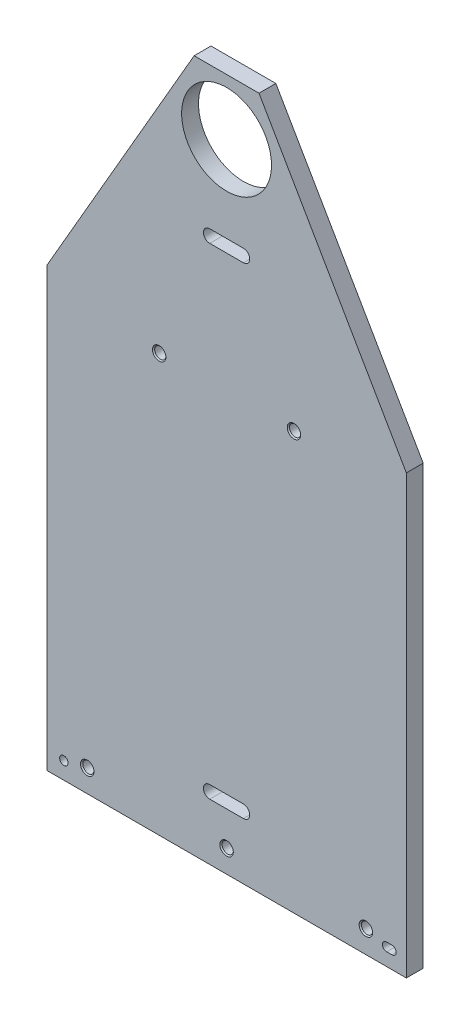
ISO-10303-21;
HEADER;
FILE_DESCRIPTION(('STEP AP214'),'2;1');
FILE_NAME('part.step','',(''),(''),'','','');
FILE_SCHEMA(('AUTOMOTIVE_DESIGN { 1 0 10303 214 1 1 1 1 }'));
ENDSEC;
DATA;
#1=APPLICATION_CONTEXT('core data for automotive mechanical design processes');
#2=APPLICATION_PROTOCOL_DEFINITION('international standard','automotive_design',2000,#1);
#3=PRODUCT_CONTEXT('',#1,'mechanical');
#4=PRODUCT('Part','Part','',(#3));
#5=PRODUCT_RELATED_PRODUCT_CATEGORY('part','',(#4));
#6=PRODUCT_DEFINITION_FORMATION('','',#4);
#7=PRODUCT_DEFINITION_CONTEXT('part definition',#1,'design');
#8=PRODUCT_DEFINITION('design','',#6,#7);
#9=PRODUCT_DEFINITION_SHAPE('','',#8);
#10=(LENGTH_UNIT() NAMED_UNIT(*) SI_UNIT(.MILLI.,.METRE.));
#11=(NAMED_UNIT(*) PLANE_ANGLE_UNIT() SI_UNIT($,.RADIAN.));
#12=(NAMED_UNIT(*) SI_UNIT($,.STERADIAN.) SOLID_ANGLE_UNIT());
#13=UNCERTAINTY_MEASURE_WITH_UNIT(LENGTH_MEASURE(1.E-05),#10,'distance_accuracy_value','');
#14=(GEOMETRIC_REPRESENTATION_CONTEXT(3) GLOBAL_UNCERTAINTY_ASSIGNED_CONTEXT((#13)) GLOBAL_UNIT_ASSIGNED_CONTEXT((#10,
#11,#12)) REPRESENTATION_CONTEXT('',''));
#15=CARTESIAN_POINT('',(0.,0.,0.));
#16=DIRECTION('',(0.,0.,1.));
#17=DIRECTION('',(1.,0.,0.));
#18=AXIS2_PLACEMENT_3D('',#15,#16,#17);
#19=CARTESIAN_POINT('',(0.,0.,4.7625));
#20=DIRECTION('',(0.,0.,-1.));
#21=DIRECTION('',(-1.,0.,0.));
#22=AXIS2_PLACEMENT_3D('',#19,#20,#21);
#23=PLANE('',#22);
#24=CARTESIAN_POINT('',(0.,12.6999999999998,4.7625));
#25=DIRECTION('',(0.,0.,1.));
#26=DIRECTION('',(1.,0.,0.));
#27=AXIS2_PLACEMENT_3D('',#24,#25,#26);
#28=CIRCLE('',#27,3.81);
#29=CARTESIAN_POINT('',(3.80999999999999,12.6999999999998,4.7625));
#30=VERTEX_POINT('',#29);
#31=EDGE_CURVE('E508',#30,#30,#28,.T.);
#32=ORIENTED_EDGE('',*,*,#31,.F.);
#33=EDGE_LOOP('',(#32));
#34=FACE_BOUND('',#33,.T.);
#35=CARTESIAN_POINT('',(78.74,12.6999999999998,4.7625));
#36=DIRECTION('',(0.,0.,1.));
#37=DIRECTION('',(1.,0.,0.));
#38=AXIS2_PLACEMENT_3D('',#35,#36,#37);
#39=CIRCLE('',#38,3.80999999999999);
#40=CARTESIAN_POINT('',(82.55,12.6999999999998,4.7625));
#41=VERTEX_POINT('',#40);
#42=EDGE_CURVE('E521',#41,#41,#39,.T.);
#43=ORIENTED_EDGE('',*,*,#42,.F.);
#44=EDGE_LOOP('',(#43));
#45=FACE_BOUND('',#44,.T.);
#46=CARTESIAN_POINT('',(38.1,235.8771,4.7625));
#47=DIRECTION('',(0.,0.,1.));
#48=DIRECTION('',(1.,0.,0.));
#49=AXIS2_PLACEMENT_3D('',#46,#47,#48);
#50=CIRCLE('',#49,3.81);
#51=CARTESIAN_POINT('',(41.91,235.8771,4.7625));
#52=VERTEX_POINT('',#51);
#53=EDGE_CURVE('E225',#52,#52,#50,.T.);
#54=ORIENTED_EDGE('',*,*,#53,.F.);
#55=EDGE_LOOP('',(#54));
#56=FACE_BOUND('',#55,.T.);
#57=DIRECTION('',(-1.,0.,0.));
#58=VECTOR('',#57,1.);
#59=CARTESIAN_POINT('',(9.52499999999995,311.162700000002,4.7625));
#60=LINE('',#59,#58);
#61=CARTESIAN_POINT('',(9.52499999999995,311.162700000002,4.7625));
#62=VERTEX_POINT('',#61);
#63=CARTESIAN_POINT('',(-9.52500000000005,311.162700000002,4.7625));
#64=VERTEX_POINT('',#63);
#65=EDGE_CURVE('E250',#62,#64,#60,.T.);
#66=ORIENTED_EDGE('',*,*,#65,.F.);
#67=CARTESIAN_POINT('',(9.52499999999994,307.594000000002,4.7625));
#68=DIRECTION('',(0.,0.,1.));
#69=DIRECTION('',(1.,0.,0.));
#70=AXIS2_PLACEMENT_3D('',#67,#68,#69);
#71=CIRCLE('',#70,3.56869999999998);
#72=CARTESIAN_POINT('',(9.52499999999995,304.025300000002,4.7625));
#73=VERTEX_POINT('',#72);
#74=EDGE_CURVE('E234',#73,#62,#71,.T.);
#75=ORIENTED_EDGE('',*,*,#74,.F.);
#76=DIRECTION('',(1.,0.,0.));
#77=VECTOR('',#76,1.);
#78=CARTESIAN_POINT('',(9.52499999999995,304.025300000002,4.7625));
#79=LINE('',#78,#77);
#80=CARTESIAN_POINT('',(-9.52500000000005,304.025300000002,4.7625));
#81=VERTEX_POINT('',#80);
#82=EDGE_CURVE('E239',#81,#73,#79,.T.);
#83=ORIENTED_EDGE('',*,*,#82,.F.);
#84=CARTESIAN_POINT('',(-9.52500000000006,307.594000000002,4.7625));
#85=DIRECTION('',(0.,0.,1.));
#86=DIRECTION('',(1.,0.,0.));
#87=AXIS2_PLACEMENT_3D('',#84,#85,#86);
#88=CIRCLE('',#87,3.56870000000001);
#89=EDGE_CURVE('E253',#64,#81,#88,.T.);
#90=ORIENTED_EDGE('',*,*,#89,.F.);
#91=EDGE_LOOP('',(#66,#75,#83,#90));
#92=FACE_BOUND('',#91,.T.);
#93=DIRECTION('',(-1.,0.,0.));
#94=VECTOR('',#93,1.);
#95=CARTESIAN_POINT('',(9.52500000000009,39.1287000000017,4.7625));
#96=LINE('',#95,#94);
#97=CARTESIAN_POINT('',(9.52500000000009,39.1287000000017,4.7625));
#98=VERTEX_POINT('',#97);
#99=CARTESIAN_POINT('',(-9.52499999999991,39.1287000000017,4.7625));
#100=VERTEX_POINT('',#99);
#101=EDGE_CURVE('E282',#98,#100,#96,.T.);
#102=ORIENTED_EDGE('',*,*,#101,.F.);
#103=CARTESIAN_POINT('',(9.5250000000001,35.5600000000017,4.7625));
#104=DIRECTION('',(0.,0.,1.));
#105=DIRECTION('',(-1.,0.,0.));
#106=AXIS2_PLACEMENT_3D('',#103,#104,#105);
#107=CIRCLE('',#106,3.5687);
#108=CARTESIAN_POINT('',(9.52500000000009,31.9913000000017,4.7625));
#109=VERTEX_POINT('',#108);
#110=EDGE_CURVE('E260',#109,#98,#107,.T.);
#111=ORIENTED_EDGE('',*,*,#110,.F.);
#112=DIRECTION('',(1.,0.,0.));
#113=VECTOR('',#112,1.);
#114=CARTESIAN_POINT('',(9.52500000000009,31.9913000000017,4.7625));
#115=LINE('',#114,#113);
#116=CARTESIAN_POINT('',(-9.52499999999991,31.9913000000017,4.7625));
#117=VERTEX_POINT('',#116);
#118=EDGE_CURVE('E271',#117,#109,#115,.T.);
#119=ORIENTED_EDGE('',*,*,#118,.F.);
#120=CARTESIAN_POINT('',(-9.5249999999999,35.5600000000017,4.7625));
#121=DIRECTION('',(0.,0.,1.));
#122=DIRECTION('',(-1.,0.,0.));
#123=AXIS2_PLACEMENT_3D('',#120,#121,#122);
#124=CIRCLE('',#123,3.5687);
#125=EDGE_CURVE('E285',#100,#117,#124,.T.);
#126=ORIENTED_EDGE('',*,*,#125,.F.);
#127=EDGE_LOOP('',(#102,#111,#119,#126));
#128=FACE_BOUND('',#127,.T.);
#129=CARTESIAN_POINT('',(0.,359.7021,4.7625));
#130=DIRECTION('',(0.,0.,1.));
#131=DIRECTION('',(1.,0.,0.));
#132=AXIS2_PLACEMENT_3D('',#129,#130,#131);
#133=CIRCLE('',#132,25.4);
#134=CARTESIAN_POINT('',(25.4,359.7021,4.7625));
#135=VERTEX_POINT('',#134);
#136=EDGE_CURVE('E292',#135,#135,#133,.T.);
#137=ORIENTED_EDGE('',*,*,#136,.F.);
#138=EDGE_LOOP('',(#137));
#139=FACE_BOUND('',#138,.T.);
#140=DIRECTION('',(0.,-1.,0.));
#141=VECTOR('',#140,1.);
#142=CARTESIAN_POINT('',(-101.6,0.,4.7625));
#143=LINE('',#142,#141);
#144=CARTESIAN_POINT('',(-101.6,247.225737951,4.7625));
#145=VERTEX_POINT('',#144);
#146=CARTESIAN_POINT('',(-101.6,0.,4.7625));
#147=VERTEX_POINT('',#146);
#148=EDGE_CURVE('E302',#145,#147,#143,.T.);
#149=ORIENTED_EDGE('',*,*,#148,.T.);
#150=DIRECTION('',(1.,0.,0.));
#151=VECTOR('',#150,1.);
#152=CARTESIAN_POINT('',(-101.6,0.,4.7625));
#153=LINE('',#152,#151);
#154=CARTESIAN_POINT('',(101.6,0.,4.7625));
#155=VERTEX_POINT('',#154);
#156=EDGE_CURVE('E326',#147,#155,#153,.T.);
#157=ORIENTED_EDGE('',*,*,#156,.T.);
#158=DIRECTION('',(0.,1.,0.));
#159=VECTOR('',#158,1.);
#160=CARTESIAN_POINT('',(101.6,247.225737951,4.7625));
#161=LINE('',#160,#159);
#162=CARTESIAN_POINT('',(101.6,247.225737951,4.7625));
#163=VERTEX_POINT('',#162);
#164=EDGE_CURVE('E329',#155,#163,#161,.T.);
#165=ORIENTED_EDGE('',*,*,#164,.T.);
#166=DIRECTION('',(-0.499999999999994,0.866025403784442,0.));
#167=VECTOR('',#166,1.);
#168=CARTESIAN_POINT('',(18.3308710467708,391.4521,4.7625));
#169=LINE('',#168,#167);
#170=CARTESIAN_POINT('',(18.3308710467708,391.4521,4.7625));
#171=VERTEX_POINT('',#170);
#172=EDGE_CURVE('E332',#163,#171,#169,.T.);
#173=ORIENTED_EDGE('',*,*,#172,.T.);
#174=DIRECTION('',(-1.,0.,0.));
#175=VECTOR('',#174,1.);
#176=CARTESIAN_POINT('',(-18.3308710467708,391.4521,4.7625));
#177=LINE('',#176,#175);
#178=CARTESIAN_POINT('',(-18.3308710467708,391.4521,4.7625));
#179=VERTEX_POINT('',#178);
#180=EDGE_CURVE('E335',#171,#179,#177,.T.);
#181=ORIENTED_EDGE('',*,*,#180,.T.);
#182=DIRECTION('',(-0.499999999999994,-0.866025403784442,0.));
#183=VECTOR('',#182,1.);
#184=CARTESIAN_POINT('',(-18.3308710467708,391.4521,4.7625));
#185=LINE('',#184,#183);
#186=EDGE_CURVE('E309',#179,#145,#185,.T.);
#187=ORIENTED_EDGE('',*,*,#186,.T.);
#188=EDGE_LOOP('',(#149,#157,#165,#173,#181,#187));
#189=FACE_BOUND('',#188,.T.);
#190=CARTESIAN_POINT('',(-38.1,235.8771,4.7625));
#191=DIRECTION('',(0.,0.,1.));
#192=DIRECTION('',(1.,0.,0.));
#193=AXIS2_PLACEMENT_3D('',#190,#191,#192);
#194=CIRCLE('',#193,3.81);
#195=CARTESIAN_POINT('',(-34.29,235.8771,4.7625));
#196=VERTEX_POINT('',#195);
#197=EDGE_CURVE('E213',#196,#196,#194,.T.);
#198=ORIENTED_EDGE('',*,*,#197,.F.);
#199=EDGE_LOOP('',(#198));
#200=FACE_BOUND('',#199,.T.);
#201=CARTESIAN_POINT('',(-91.9480000000001,9.65199999999999,4.7625));
#202=DIRECTION('',(0.,0.,1.));
#203=DIRECTION('',(1.,0.,0.));
#204=AXIS2_PLACEMENT_3D('',#201,#202,#203);
#205=CIRCLE('',#204,2.3876);
#206=CARTESIAN_POINT('',(-89.5604000000001,9.65199999999999,4.7625));
#207=VERTEX_POINT('',#206);
#208=EDGE_CURVE('E201',#207,#207,#205,.T.);
#209=ORIENTED_EDGE('',*,*,#208,.F.);
#210=EDGE_LOOP('',(#209));
#211=FACE_BOUND('',#210,.T.);
#212=DIRECTION('',(1.,0.,0.));
#213=VECTOR('',#212,1.);
#214=CARTESIAN_POINT('',(90.424,7.2644,4.7625));
#215=LINE('',#214,#213);
#216=CARTESIAN_POINT('',(90.424,7.2644,4.7625));
#217=VERTEX_POINT('',#216);
#218=CARTESIAN_POINT('',(93.4720000000001,7.2644,4.7625));
#219=VERTEX_POINT('',#218);
#220=EDGE_CURVE('E195',#217,#219,#215,.T.);
#221=ORIENTED_EDGE('',*,*,#220,.F.);
#222=CARTESIAN_POINT('',(90.424,9.65199999999999,4.7625));
#223=DIRECTION('',(0.,0.,1.));
#224=DIRECTION('',(1.,0.,0.));
#225=AXIS2_PLACEMENT_3D('',#222,#223,#224);
#226=CIRCLE('',#225,2.38759999999999);
#227=CARTESIAN_POINT('',(90.424,12.0396,4.7625));
#228=VERTEX_POINT('',#227);
#229=EDGE_CURVE('E56',#228,#217,#226,.T.);
#230=ORIENTED_EDGE('',*,*,#229,.F.);
#231=DIRECTION('',(-1.,0.,0.));
#232=VECTOR('',#231,1.);
#233=CARTESIAN_POINT('',(90.424,12.0396,4.7625));
#234=LINE('',#233,#232);
#235=CARTESIAN_POINT('',(93.4720000000001,12.0396,4.7625));
#236=VERTEX_POINT('',#235);
#237=EDGE_CURVE('E183',#236,#228,#234,.T.);
#238=ORIENTED_EDGE('',*,*,#237,.F.);
#239=CARTESIAN_POINT('',(93.4720000000001,9.65199999999999,4.7625));
#240=DIRECTION('',(0.,0.,1.));
#241=DIRECTION('',(1.,0.,0.));
#242=AXIS2_PLACEMENT_3D('',#239,#240,#241);
#243=CIRCLE('',#242,2.38759999999999);
#244=EDGE_CURVE('E186',#219,#236,#243,.T.);
#245=ORIENTED_EDGE('',*,*,#244,.F.);
#246=EDGE_LOOP('',(#221,#230,#238,#245));
#247=FACE_BOUND('',#246,.T.);
#248=CARTESIAN_POINT('',(-78.74,12.6999999999998,4.7625));
#249=DIRECTION('',(0.,0.,1.));
#250=DIRECTION('',(1.,0.,0.));
#251=AXIS2_PLACEMENT_3D('',#248,#249,#250);
#252=CIRCLE('',#251,3.80999999999999);
#253=CARTESIAN_POINT('',(-74.93,12.6999999999998,4.7625));
#254=VERTEX_POINT('',#253);
#255=EDGE_CURVE('E533',#254,#254,#252,.T.);
#256=ORIENTED_EDGE('',*,*,#255,.F.);
#257=EDGE_LOOP('',(#256));
#258=FACE_BOUND('',#257,.T.);
#259=ADVANCED_FACE('F39',(#34,#45,#56,#92,#128,#139,#189,#200,#211,#247,#258),#23,.F.);
#260=CARTESIAN_POINT('',(-101.6,0.,-4.7625));
#261=DIRECTION('',(-1.,0.,0.));
#262=DIRECTION('',(0.,-1.,0.));
#263=AXIS2_PLACEMENT_3D('',#260,#261,#262);
#264=PLANE('',#263);
#265=ORIENTED_EDGE('',*,*,#148,.F.);
#266=DIRECTION('',(0.,0.,1.));
#267=VECTOR('',#266,1.);
#268=CARTESIAN_POINT('',(-101.6,247.225737951,-4.7625));
#269=LINE('',#268,#267);
#270=CARTESIAN_POINT('',(-101.6,247.225737951,-4.7625));
#271=VERTEX_POINT('',#270);
#272=EDGE_CURVE('E11',#271,#145,#269,.T.);
#273=ORIENTED_EDGE('',*,*,#272,.F.);
#274=DIRECTION('',(0.,-1.,0.));
#275=VECTOR('',#274,1.);
#276=CARTESIAN_POINT('',(-101.6,0.,-4.7625));
#277=LINE('',#276,#275);
#278=CARTESIAN_POINT('',(-101.6,0.,-4.7625));
#279=VERTEX_POINT('',#278);
#280=EDGE_CURVE('E305',#271,#279,#277,.T.);
#281=ORIENTED_EDGE('',*,*,#280,.T.);
#282=DIRECTION('',(0.,0.,1.));
#283=VECTOR('',#282,1.);
#284=CARTESIAN_POINT('',(-101.6,0.,-4.7625));
#285=LINE('',#284,#283);
#286=EDGE_CURVE('E43',#279,#147,#285,.T.);
#287=ORIENTED_EDGE('',*,*,#286,.T.);
#288=EDGE_LOOP('',(#265,#273,#281,#287));
#289=FACE_BOUND('',#288,.T.);
#290=ADVANCED_FACE('F41',(#289),#264,.T.);
#291=CARTESIAN_POINT('',(-18.3308710467708,391.4521,-4.7625));
#292=DIRECTION('',(-0.866025403784442,0.499999999999994,0.));
#293=DIRECTION('',(-0.499999999999994,-0.866025403784442,0.));
#294=AXIS2_PLACEMENT_3D('',#291,#292,#293);
#295=PLANE('',#294);
#296=ORIENTED_EDGE('',*,*,#186,.F.);
#297=DIRECTION('',(0.,0.,1.));
#298=VECTOR('',#297,1.);
#299=CARTESIAN_POINT('',(-18.3308710467708,391.4521,-4.7625));
#300=LINE('',#299,#298);
#301=CARTESIAN_POINT('',(-18.3308710467708,391.4521,-4.7625));
#302=VERTEX_POINT('',#301);
#303=EDGE_CURVE('E48',#302,#179,#300,.T.);
#304=ORIENTED_EDGE('',*,*,#303,.F.);
#305=DIRECTION('',(-0.499999999999994,-0.866025403784442,0.));
#306=VECTOR('',#305,1.);
#307=CARTESIAN_POINT('',(-18.3308710467708,391.4521,-4.7625));
#308=LINE('',#307,#306);
#309=EDGE_CURVE('E321',#302,#271,#308,.T.);
#310=ORIENTED_EDGE('',*,*,#309,.T.);
#311=ORIENTED_EDGE('',*,*,#272,.T.);
#312=EDGE_LOOP('',(#296,#304,#310,#311));
#313=FACE_BOUND('',#312,.T.);
#314=ADVANCED_FACE('F358',(#313),#295,.T.);
#315=CARTESIAN_POINT('',(-18.3308710467708,391.4521,-4.7625));
#316=DIRECTION('',(0.,1.,0.));
#317=DIRECTION('',(0.,0.,1.));
#318=AXIS2_PLACEMENT_3D('',#315,#316,#317);
#319=PLANE('',#318);
#320=ORIENTED_EDGE('',*,*,#180,.F.);
#321=DIRECTION('',(0.,0.,1.));
#322=VECTOR('',#321,1.);
#323=CARTESIAN_POINT('',(18.3308710467708,391.4521,-4.7625));
#324=LINE('',#323,#322);
#325=CARTESIAN_POINT('',(18.3308710467708,391.4521,-4.7625));
#326=VERTEX_POINT('',#325);
#327=EDGE_CURVE('E341',#326,#171,#324,.T.);
#328=ORIENTED_EDGE('',*,*,#327,.F.);
#329=DIRECTION('',(-1.,0.,0.));
#330=VECTOR('',#329,1.);
#331=CARTESIAN_POINT('',(-18.3308710467708,391.4521,-4.7625));
#332=LINE('',#331,#330);
#333=EDGE_CURVE('E318',#326,#302,#332,.T.);
#334=ORIENTED_EDGE('',*,*,#333,.T.);
#335=ORIENTED_EDGE('',*,*,#303,.T.);
#336=EDGE_LOOP('',(#320,#328,#334,#335));
#337=FACE_BOUND('',#336,.T.);
#338=ADVANCED_FACE('F370',(#337),#319,.T.);
#339=CARTESIAN_POINT('',(18.3308710467708,391.4521,-4.7625));
#340=DIRECTION('',(0.866025403784442,0.499999999999994,0.));
#341=DIRECTION('',(-0.499999999999994,0.866025403784442,0.));
#342=AXIS2_PLACEMENT_3D('',#339,#340,#341);
#343=PLANE('',#342);
#344=ORIENTED_EDGE('',*,*,#172,.F.);
#345=DIRECTION('',(0.,0.,1.));
#346=VECTOR('',#345,1.);
#347=CARTESIAN_POINT('',(101.6,247.225737951,-4.7625));
#348=LINE('',#347,#346);
#349=CARTESIAN_POINT('',(101.6,247.225737951,-4.7625));
#350=VERTEX_POINT('',#349);
#351=EDGE_CURVE('E343',#350,#163,#348,.T.);
#352=ORIENTED_EDGE('',*,*,#351,.F.);
#353=DIRECTION('',(-0.499999999999994,0.866025403784442,0.));
#354=VECTOR('',#353,1.);
#355=CARTESIAN_POINT('',(18.3308710467708,391.4521,-4.7625));
#356=LINE('',#355,#354);
#357=EDGE_CURVE('E315',#350,#326,#356,.T.);
#358=ORIENTED_EDGE('',*,*,#357,.T.);
#359=ORIENTED_EDGE('',*,*,#327,.T.);
#360=EDGE_LOOP('',(#344,#352,#358,#359));
#361=FACE_BOUND('',#360,.T.);
#362=ADVANCED_FACE('F368',(#361),#343,.T.);
#363=CARTESIAN_POINT('',(101.6,247.225737951,-4.7625));
#364=DIRECTION('',(1.,0.,0.));
#365=DIRECTION('',(0.,1.,0.));
#366=AXIS2_PLACEMENT_3D('',#363,#364,#365);
#367=PLANE('',#366);
#368=ORIENTED_EDGE('',*,*,#164,.F.);
#369=DIRECTION('',(0.,0.,1.));
#370=VECTOR('',#369,1.);
#371=CARTESIAN_POINT('',(101.6,0.,-4.7625));
#372=LINE('',#371,#370);
#373=CARTESIAN_POINT('',(101.6,0.,-4.7625));
#374=VERTEX_POINT('',#373);
#375=EDGE_CURVE('E344',#374,#155,#372,.T.);
#376=ORIENTED_EDGE('',*,*,#375,.F.);
#377=DIRECTION('',(0.,1.,0.));
#378=VECTOR('',#377,1.);
#379=CARTESIAN_POINT('',(101.6,247.225737951,-4.7625));
#380=LINE('',#379,#378);
#381=EDGE_CURVE('E312',#374,#350,#380,.T.);
#382=ORIENTED_EDGE('',*,*,#381,.T.);
#383=ORIENTED_EDGE('',*,*,#351,.T.);
#384=EDGE_LOOP('',(#368,#376,#382,#383));
#385=FACE_BOUND('',#384,.T.);
#386=ADVANCED_FACE('F365',(#385),#367,.T.);
#387=CARTESIAN_POINT('',(-101.6,0.,-4.7625));
#388=DIRECTION('',(0.,-1.,0.));
#389=DIRECTION('',(1.,0.,0.));
#390=AXIS2_PLACEMENT_3D('',#387,#388,#389);
#391=PLANE('',#390);
#392=ORIENTED_EDGE('',*,*,#156,.F.);
#393=ORIENTED_EDGE('',*,*,#286,.F.);
#394=DIRECTION('',(1.,0.,0.));
#395=VECTOR('',#394,1.);
#396=CARTESIAN_POINT('',(-101.6,0.,-4.7625));
#397=LINE('',#396,#395);
#398=EDGE_CURVE('E308',#279,#374,#397,.T.);
#399=ORIENTED_EDGE('',*,*,#398,.T.);
#400=ORIENTED_EDGE('',*,*,#375,.T.);
#401=EDGE_LOOP('',(#392,#393,#399,#400));
#402=FACE_BOUND('',#401,.T.);
#403=ADVANCED_FACE('F352',(#402),#391,.T.);
#404=CARTESIAN_POINT('',(0.,0.,-4.7625));
#405=DIRECTION('',(0.,0.,-1.));
#406=DIRECTION('',(-1.,0.,0.));
#407=AXIS2_PLACEMENT_3D('',#404,#405,#406);
#408=PLANE('',#407);
#409=CARTESIAN_POINT('',(0.,12.6999999999998,-4.7625));
#410=DIRECTION('',(0.,0.,1.));
#411=DIRECTION('',(1.,0.,0.));
#412=AXIS2_PLACEMENT_3D('',#409,#410,#411);
#413=CIRCLE('',#412,3.81);
#414=CARTESIAN_POINT('',(3.80999999999999,12.6999999999998,-4.7625));
#415=VERTEX_POINT('',#414);
#416=EDGE_CURVE('E509',#415,#415,#413,.T.);
#417=ORIENTED_EDGE('',*,*,#416,.T.);
#418=EDGE_LOOP('',(#417));
#419=FACE_BOUND('',#418,.T.);
#420=CARTESIAN_POINT('',(78.74,12.6999999999998,-4.7625));
#421=DIRECTION('',(0.,0.,1.));
#422=DIRECTION('',(1.,0.,0.));
#423=AXIS2_PLACEMENT_3D('',#420,#421,#422);
#424=CIRCLE('',#423,3.80999999999999);
#425=CARTESIAN_POINT('',(82.55,12.6999999999998,-4.7625));
#426=VERTEX_POINT('',#425);
#427=EDGE_CURVE('E518',#426,#426,#424,.T.);
#428=ORIENTED_EDGE('',*,*,#427,.T.);
#429=EDGE_LOOP('',(#428));
#430=FACE_BOUND('',#429,.T.);
#431=CARTESIAN_POINT('',(-78.74,12.6999999999998,-4.7625));
#432=DIRECTION('',(0.,0.,1.));
#433=DIRECTION('',(1.,0.,0.));
#434=AXIS2_PLACEMENT_3D('',#431,#432,#433);
#435=CIRCLE('',#434,3.80999999999999);
#436=CARTESIAN_POINT('',(-74.93,12.6999999999998,-4.7625));
#437=VERTEX_POINT('',#436);
#438=EDGE_CURVE('E530',#437,#437,#435,.T.);
#439=ORIENTED_EDGE('',*,*,#438,.T.);
#440=EDGE_LOOP('',(#439));
#441=FACE_BOUND('',#440,.T.);
#442=CARTESIAN_POINT('',(90.424,9.65199999999999,-4.7625));
#443=DIRECTION('',(0.,0.,1.));
#444=DIRECTION('',(1.,0.,0.));
#445=AXIS2_PLACEMENT_3D('',#442,#443,#444);
#446=CIRCLE('',#445,2.38759999999999);
#447=CARTESIAN_POINT('',(90.424,12.0396,-4.7625));
#448=VERTEX_POINT('',#447);
#449=CARTESIAN_POINT('',(90.424,7.2644,-4.7625));
#450=VERTEX_POINT('',#449);
#451=EDGE_CURVE('E167',#448,#450,#446,.T.);
#452=ORIENTED_EDGE('',*,*,#451,.T.);
#453=DIRECTION('',(1.,0.,0.));
#454=VECTOR('',#453,1.);
#455=CARTESIAN_POINT('',(90.424,7.2644,-4.7625));
#456=LINE('',#455,#454);
#457=CARTESIAN_POINT('',(93.4720000000001,7.2644,-4.7625));
#458=VERTEX_POINT('',#457);
#459=EDGE_CURVE('E176',#450,#458,#456,.T.);
#460=ORIENTED_EDGE('',*,*,#459,.T.);
#461=CARTESIAN_POINT('',(93.4720000000001,9.65199999999999,-4.7625));
#462=DIRECTION('',(0.,0.,1.));
#463=DIRECTION('',(1.,0.,0.));
#464=AXIS2_PLACEMENT_3D('',#461,#462,#463);
#465=CIRCLE('',#464,2.38759999999999);
#466=CARTESIAN_POINT('',(93.4720000000001,12.0396,-4.7625));
#467=VERTEX_POINT('',#466);
#468=EDGE_CURVE('E64',#458,#467,#465,.T.);
#469=ORIENTED_EDGE('',*,*,#468,.T.);
#470=DIRECTION('',(-1.,0.,0.));
#471=VECTOR('',#470,1.);
#472=CARTESIAN_POINT('',(90.424,12.0396,-4.7625));
#473=LINE('',#472,#471);
#474=EDGE_CURVE('E173',#467,#448,#473,.T.);
#475=ORIENTED_EDGE('',*,*,#474,.T.);
#476=EDGE_LOOP('',(#452,#460,#469,#475));
#477=FACE_BOUND('',#476,.T.);
#478=CARTESIAN_POINT('',(-91.9480000000001,9.65199999999999,-4.7625));
#479=DIRECTION('',(0.,0.,1.));
#480=DIRECTION('',(1.,0.,0.));
#481=AXIS2_PLACEMENT_3D('',#478,#479,#480);
#482=CIRCLE('',#481,2.3876);
#483=CARTESIAN_POINT('',(-89.5604000000001,9.65199999999999,-4.7625));
#484=VERTEX_POINT('',#483);
#485=EDGE_CURVE('E207',#484,#484,#482,.T.);
#486=ORIENTED_EDGE('',*,*,#485,.T.);
#487=EDGE_LOOP('',(#486));
#488=FACE_BOUND('',#487,.T.);
#489=CARTESIAN_POINT('',(-38.1,235.8771,-4.7625));
#490=DIRECTION('',(0.,0.,1.));
#491=DIRECTION('',(1.,0.,0.));
#492=AXIS2_PLACEMENT_3D('',#489,#490,#491);
#493=CIRCLE('',#492,3.81);
#494=CARTESIAN_POINT('',(-34.29,235.8771,-4.7625));
#495=VERTEX_POINT('',#494);
#496=EDGE_CURVE('E210',#495,#495,#493,.T.);
#497=ORIENTED_EDGE('',*,*,#496,.T.);
#498=EDGE_LOOP('',(#497));
#499=FACE_BOUND('',#498,.T.);
#500=CARTESIAN_POINT('',(38.1,235.8771,-4.7625));
#501=DIRECTION('',(0.,0.,1.));
#502=DIRECTION('',(1.,0.,0.));
#503=AXIS2_PLACEMENT_3D('',#500,#501,#502);
#504=CIRCLE('',#503,3.80999999999999);
#505=CARTESIAN_POINT('',(41.91,235.8771,-4.7625));
#506=VERTEX_POINT('',#505);
#507=EDGE_CURVE('E222',#506,#506,#504,.T.);
#508=ORIENTED_EDGE('',*,*,#507,.T.);
#509=EDGE_LOOP('',(#508));
#510=FACE_BOUND('',#509,.T.);
#511=CARTESIAN_POINT('',(9.52499999999994,307.594000000002,-4.7625));
#512=DIRECTION('',(0.,0.,1.));
#513=DIRECTION('',(1.,0.,0.));
#514=AXIS2_PLACEMENT_3D('',#511,#512,#513);
#515=CIRCLE('',#514,3.56869999999998);
#516=CARTESIAN_POINT('',(9.52499999999995,304.025300000002,-4.7625));
#517=VERTEX_POINT('',#516);
#518=CARTESIAN_POINT('',(9.52499999999995,311.162700000002,-4.7625));
#519=VERTEX_POINT('',#518);
#520=EDGE_CURVE('E235',#517,#519,#515,.T.);
#521=ORIENTED_EDGE('',*,*,#520,.T.);
#522=DIRECTION('',(-1.,0.,0.));
#523=VECTOR('',#522,1.);
#524=CARTESIAN_POINT('',(9.52499999999995,311.162700000002,-4.7625));
#525=LINE('',#524,#523);
#526=CARTESIAN_POINT('',(-9.52500000000005,311.162700000002,-4.7625));
#527=VERTEX_POINT('',#526);
#528=EDGE_CURVE('E238',#519,#527,#525,.T.);
#529=ORIENTED_EDGE('',*,*,#528,.T.);
#530=CARTESIAN_POINT('',(-9.52500000000006,307.594000000002,-4.7625));
#531=DIRECTION('',(0.,0.,1.));
#532=DIRECTION('',(1.,0.,0.));
#533=AXIS2_PLACEMENT_3D('',#530,#531,#532);
#534=CIRCLE('',#533,3.56870000000001);
#535=CARTESIAN_POINT('',(-9.52500000000005,304.025300000002,-4.7625));
#536=VERTEX_POINT('',#535);
#537=EDGE_CURVE('E242',#527,#536,#534,.T.);
#538=ORIENTED_EDGE('',*,*,#537,.T.);
#539=DIRECTION('',(1.,0.,0.));
#540=VECTOR('',#539,1.);
#541=CARTESIAN_POINT('',(9.52499999999995,304.025300000002,-4.7625));
#542=LINE('',#541,#540);
#543=EDGE_CURVE('E245',#536,#517,#542,.T.);
#544=ORIENTED_EDGE('',*,*,#543,.T.);
#545=EDGE_LOOP('',(#521,#529,#538,#544));
#546=FACE_BOUND('',#545,.T.);
#547=CARTESIAN_POINT('',(9.5250000000001,35.5600000000017,-4.7625));
#548=DIRECTION('',(0.,0.,1.));
#549=DIRECTION('',(-1.,0.,0.));
#550=AXIS2_PLACEMENT_3D('',#547,#548,#549);
#551=CIRCLE('',#550,3.5687);
#552=CARTESIAN_POINT('',(9.52500000000009,31.9913000000017,-4.7625));
#553=VERTEX_POINT('',#552);
#554=CARTESIAN_POINT('',(9.52500000000009,39.1287000000017,-4.7625));
#555=VERTEX_POINT('',#554);
#556=EDGE_CURVE('E267',#553,#555,#551,.T.);
#557=ORIENTED_EDGE('',*,*,#556,.T.);
#558=DIRECTION('',(-1.,0.,0.));
#559=VECTOR('',#558,1.);
#560=CARTESIAN_POINT('',(9.52500000000009,39.1287000000017,-4.7625));
#561=LINE('',#560,#559);
#562=CARTESIAN_POINT('',(-9.52499999999991,39.1287000000017,-4.7625));
#563=VERTEX_POINT('',#562);
#564=EDGE_CURVE('E270',#555,#563,#561,.T.);
#565=ORIENTED_EDGE('',*,*,#564,.T.);
#566=CARTESIAN_POINT('',(-9.5249999999999,35.5600000000017,-4.7625));
#567=DIRECTION('',(0.,0.,1.));
#568=DIRECTION('',(-1.,0.,0.));
#569=AXIS2_PLACEMENT_3D('',#566,#567,#568);
#570=CIRCLE('',#569,3.5687);
#571=CARTESIAN_POINT('',(-9.52499999999991,31.9913000000017,-4.7625));
#572=VERTEX_POINT('',#571);
#573=EDGE_CURVE('E274',#563,#572,#570,.T.);
#574=ORIENTED_EDGE('',*,*,#573,.T.);
#575=DIRECTION('',(1.,0.,0.));
#576=VECTOR('',#575,1.);
#577=CARTESIAN_POINT('',(9.52500000000009,31.9913000000017,-4.7625));
#578=LINE('',#577,#576);
#579=EDGE_CURVE('E277',#572,#553,#578,.T.);
#580=ORIENTED_EDGE('',*,*,#579,.T.);
#581=EDGE_LOOP('',(#557,#565,#574,#580));
#582=FACE_BOUND('',#581,.T.);
#583=CARTESIAN_POINT('',(0.,359.7021,-4.7625));
#584=DIRECTION('',(0.,0.,1.));
#585=DIRECTION('',(1.,0.,0.));
#586=AXIS2_PLACEMENT_3D('',#583,#584,#585);
#587=CIRCLE('',#586,25.4);
#588=CARTESIAN_POINT('',(25.4,359.7021,-4.7625));
#589=VERTEX_POINT('',#588);
#590=EDGE_CURVE('E299',#589,#589,#587,.T.);
#591=ORIENTED_EDGE('',*,*,#590,.T.);
#592=EDGE_LOOP('',(#591));
#593=FACE_BOUND('',#592,.T.);
#594=ORIENTED_EDGE('',*,*,#280,.F.);
#595=ORIENTED_EDGE('',*,*,#309,.F.);
#596=ORIENTED_EDGE('',*,*,#333,.F.);
#597=ORIENTED_EDGE('',*,*,#357,.F.);
#598=ORIENTED_EDGE('',*,*,#381,.F.);
#599=ORIENTED_EDGE('',*,*,#398,.F.);
#600=EDGE_LOOP('',(#594,#595,#596,#597,#598,#599));
#601=FACE_BOUND('',#600,.T.);
#602=ADVANCED_FACE('F180',(#419,#430,#441,#477,#488,#499,#510,#546,#582,#593,#601),#408,.T.);
#603=CARTESIAN_POINT('',(0.,359.7021,-4.7625));
#604=DIRECTION('',(0.,0.,1.));
#605=DIRECTION('',(1.,0.,0.));
#606=AXIS2_PLACEMENT_3D('',#603,#604,#605);
#607=CYLINDRICAL_SURFACE('',#606,25.4);
#608=ORIENTED_EDGE('',*,*,#590,.F.);
#609=EDGE_LOOP('',(#608));
#610=FACE_BOUND('',#609,.T.);
#611=ORIENTED_EDGE('',*,*,#136,.T.);
#612=EDGE_LOOP('',(#611));
#613=FACE_BOUND('',#612,.T.);
#614=ADVANCED_FACE('F390',(#610,#613),#607,.F.);
#615=CARTESIAN_POINT('',(9.5250000000001,35.5600000000017,-4.7625));
#616=DIRECTION('',(0.,0.,1.));
#617=DIRECTION('',(1.,0.,0.));
#618=AXIS2_PLACEMENT_3D('',#615,#616,#617);
#619=CYLINDRICAL_SURFACE('',#618,3.5687);
#620=ORIENTED_EDGE('',*,*,#110,.T.);
#621=DIRECTION('',(0.,0.,1.));
#622=VECTOR('',#621,1.);
#623=CARTESIAN_POINT('',(9.52500000000009,39.1287000000017,-4.7625));
#624=LINE('',#623,#622);
#625=EDGE_CURVE('E280',#555,#98,#624,.T.);
#626=ORIENTED_EDGE('',*,*,#625,.F.);
#627=ORIENTED_EDGE('',*,*,#556,.F.);
#628=DIRECTION('',(0.,0.,1.));
#629=VECTOR('',#628,1.);
#630=CARTESIAN_POINT('',(9.52500000000009,31.9913000000017,-4.7625));
#631=LINE('',#630,#629);
#632=EDGE_CURVE('E290',#553,#109,#631,.T.);
#633=ORIENTED_EDGE('',*,*,#632,.T.);
#634=EDGE_LOOP('',(#620,#626,#627,#633));
#635=FACE_BOUND('',#634,.T.);
#636=ADVANCED_FACE('F394',(#635),#619,.F.);
#637=CARTESIAN_POINT('',(9.52500000000009,31.9913000000017,-4.7625));
#638=DIRECTION('',(0.,-1.,0.));
#639=DIRECTION('',(1.,0.,0.));
#640=AXIS2_PLACEMENT_3D('',#637,#638,#639);
#641=PLANE('',#640);
#642=ORIENTED_EDGE('',*,*,#118,.T.);
#643=ORIENTED_EDGE('',*,*,#632,.F.);
#644=ORIENTED_EDGE('',*,*,#579,.F.);
#645=DIRECTION('',(0.,0.,1.));
#646=VECTOR('',#645,1.);
#647=CARTESIAN_POINT('',(-9.52499999999991,31.9913000000017,-4.7625));
#648=LINE('',#647,#646);
#649=EDGE_CURVE('E293',#572,#117,#648,.T.);
#650=ORIENTED_EDGE('',*,*,#649,.T.);
#651=EDGE_LOOP('',(#642,#643,#644,#650));
#652=FACE_BOUND('',#651,.T.);
#653=ADVANCED_FACE('F398',(#652),#641,.F.);
#654=CARTESIAN_POINT('',(-9.5249999999999,35.5600000000017,-4.7625));
#655=DIRECTION('',(0.,0.,1.));
#656=DIRECTION('',(1.,0.,0.));
#657=AXIS2_PLACEMENT_3D('',#654,#655,#656);
#658=CYLINDRICAL_SURFACE('',#657,3.5687);
#659=ORIENTED_EDGE('',*,*,#125,.T.);
#660=ORIENTED_EDGE('',*,*,#649,.F.);
#661=ORIENTED_EDGE('',*,*,#573,.F.);
#662=DIRECTION('',(0.,0.,1.));
#663=VECTOR('',#662,1.);
#664=CARTESIAN_POINT('',(-9.52499999999991,39.1287000000017,-4.7625));
#665=LINE('',#664,#663);
#666=EDGE_CURVE('E295',#563,#100,#665,.T.);
#667=ORIENTED_EDGE('',*,*,#666,.T.);
#668=EDGE_LOOP('',(#659,#660,#661,#667));
#669=FACE_BOUND('',#668,.T.);
#670=ADVANCED_FACE('F404',(#669),#658,.F.);
#671=CARTESIAN_POINT('',(9.52500000000009,39.1287000000017,-4.7625));
#672=DIRECTION('',(0.,1.,0.));
#673=DIRECTION('',(0.,0.,1.));
#674=AXIS2_PLACEMENT_3D('',#671,#672,#673);
#675=PLANE('',#674);
#676=ORIENTED_EDGE('',*,*,#101,.T.);
#677=ORIENTED_EDGE('',*,*,#666,.F.);
#678=ORIENTED_EDGE('',*,*,#564,.F.);
#679=ORIENTED_EDGE('',*,*,#625,.T.);
#680=EDGE_LOOP('',(#676,#677,#678,#679));
#681=FACE_BOUND('',#680,.T.);
#682=ADVANCED_FACE('F400',(#681),#675,.F.);
#683=CARTESIAN_POINT('',(9.52499999999994,307.594000000002,-4.7625));
#684=DIRECTION('',(0.,0.,1.));
#685=DIRECTION('',(1.,0.,0.));
#686=AXIS2_PLACEMENT_3D('',#683,#684,#685);
#687=CYLINDRICAL_SURFACE('',#686,3.56869999999998);
#688=ORIENTED_EDGE('',*,*,#74,.T.);
#689=DIRECTION('',(0.,0.,1.));
#690=VECTOR('',#689,1.);
#691=CARTESIAN_POINT('',(9.52499999999995,311.162700000002,-4.7625));
#692=LINE('',#691,#690);
#693=EDGE_CURVE('E248',#519,#62,#692,.T.);
#694=ORIENTED_EDGE('',*,*,#693,.F.);
#695=ORIENTED_EDGE('',*,*,#520,.F.);
#696=DIRECTION('',(0.,0.,1.));
#697=VECTOR('',#696,1.);
#698=CARTESIAN_POINT('',(9.52499999999995,304.025300000002,-4.7625));
#699=LINE('',#698,#697);
#700=EDGE_CURVE('E258',#517,#73,#699,.T.);
#701=ORIENTED_EDGE('',*,*,#700,.T.);
#702=EDGE_LOOP('',(#688,#694,#695,#701));
#703=FACE_BOUND('',#702,.T.);
#704=ADVANCED_FACE('F403',(#703),#687,.F.);
#705=CARTESIAN_POINT('',(9.52499999999995,304.025300000002,-4.7625));
#706=DIRECTION('',(0.,-1.,0.));
#707=DIRECTION('',(1.,0.,0.));
#708=AXIS2_PLACEMENT_3D('',#705,#706,#707);
#709=PLANE('',#708);
#710=ORIENTED_EDGE('',*,*,#82,.T.);
#711=ORIENTED_EDGE('',*,*,#700,.F.);
#712=ORIENTED_EDGE('',*,*,#543,.F.);
#713=DIRECTION('',(0.,0.,1.));
#714=VECTOR('',#713,1.);
#715=CARTESIAN_POINT('',(-9.52500000000005,304.025300000002,-4.7625));
#716=LINE('',#715,#714);
#717=EDGE_CURVE('E261',#536,#81,#716,.T.);
#718=ORIENTED_EDGE('',*,*,#717,.T.);
#719=EDGE_LOOP('',(#710,#711,#712,#718));
#720=FACE_BOUND('',#719,.T.);
#721=ADVANCED_FACE('F414',(#720),#709,.F.);
#722=CARTESIAN_POINT('',(-9.52500000000006,307.594000000002,-4.7625));
#723=DIRECTION('',(0.,0.,1.));
#724=DIRECTION('',(1.,0.,0.));
#725=AXIS2_PLACEMENT_3D('',#722,#723,#724);
#726=CYLINDRICAL_SURFACE('',#725,3.56870000000001);
#727=ORIENTED_EDGE('',*,*,#89,.T.);
#728=ORIENTED_EDGE('',*,*,#717,.F.);
#729=ORIENTED_EDGE('',*,*,#537,.F.);
#730=DIRECTION('',(0.,0.,1.));
#731=VECTOR('',#730,1.);
#732=CARTESIAN_POINT('',(-9.52500000000005,311.162700000002,-4.7625));
#733=LINE('',#732,#731);
#734=EDGE_CURVE('E263',#527,#64,#733,.T.);
#735=ORIENTED_EDGE('',*,*,#734,.T.);
#736=EDGE_LOOP('',(#727,#728,#729,#735));
#737=FACE_BOUND('',#736,.T.);
#738=ADVANCED_FACE('F420',(#737),#726,.F.);
#739=CARTESIAN_POINT('',(9.52499999999995,311.162700000002,-4.7625));
#740=DIRECTION('',(0.,1.,0.));
#741=DIRECTION('',(0.,0.,1.));
#742=AXIS2_PLACEMENT_3D('',#739,#740,#741);
#743=PLANE('',#742);
#744=ORIENTED_EDGE('',*,*,#65,.T.);
#745=ORIENTED_EDGE('',*,*,#734,.F.);
#746=ORIENTED_EDGE('',*,*,#528,.F.);
#747=ORIENTED_EDGE('',*,*,#693,.T.);
#748=EDGE_LOOP('',(#744,#745,#746,#747));
#749=FACE_BOUND('',#748,.T.);
#750=ADVANCED_FACE('F416',(#749),#743,.F.);
#751=CARTESIAN_POINT('',(38.1,235.8771,-4.1275));
#752=DIRECTION('',(0.,0.,-1.));
#753=DIRECTION('',(-1.,0.,0.));
#754=AXIS2_PLACEMENT_3D('',#751,#752,#753);
#755=CONICAL_SURFACE('',#754,3.175,0.785398163397443);
#756=ORIENTED_EDGE('',*,*,#507,.F.);
#757=EDGE_LOOP('',(#756));
#758=FACE_BOUND('',#757,.T.);
#759=CARTESIAN_POINT('',(38.1,235.8771,-4.1275));
#760=DIRECTION('',(0.,0.,1.));
#761=DIRECTION('',(1.,0.,0.));
#762=AXIS2_PLACEMENT_3D('',#759,#760,#761);
#763=CIRCLE('',#762,3.175);
#764=CARTESIAN_POINT('',(41.275,235.8771,-4.1275));
#765=VERTEX_POINT('',#764);
#766=EDGE_CURVE('E231',#765,#765,#763,.T.);
#767=ORIENTED_EDGE('',*,*,#766,.T.);
#768=EDGE_LOOP('',(#767));
#769=FACE_BOUND('',#768,.T.);
#770=ADVANCED_FACE('F419',(#758,#769),#755,.F.);
#771=CARTESIAN_POINT('',(38.1,235.8771,4.7625));
#772=DIRECTION('',(0.,0.,1.));
#773=DIRECTION('',(1.,0.,0.));
#774=AXIS2_PLACEMENT_3D('',#771,#772,#773);
#775=CYLINDRICAL_SURFACE('',#774,3.17499999999999);
#776=ORIENTED_EDGE('',*,*,#766,.F.);
#777=EDGE_LOOP('',(#776));
#778=FACE_BOUND('',#777,.T.);
#779=CARTESIAN_POINT('',(38.1,235.8771,4.12749999999999));
#780=DIRECTION('',(0.,0.,1.));
#781=DIRECTION('',(1.,0.,0.));
#782=AXIS2_PLACEMENT_3D('',#779,#780,#781);
#783=CIRCLE('',#782,3.17499999999998);
#784=CARTESIAN_POINT('',(41.275,235.8771,4.12749999999999));
#785=VERTEX_POINT('',#784);
#786=EDGE_CURVE('E228',#785,#785,#783,.T.);
#787=ORIENTED_EDGE('',*,*,#786,.T.);
#788=EDGE_LOOP('',(#787));
#789=FACE_BOUND('',#788,.T.);
#790=ADVANCED_FACE('F430',(#778,#789),#775,.F.);
#791=CARTESIAN_POINT('',(38.1,235.8771,4.7625));
#792=DIRECTION('',(0.,0.,1.));
#793=DIRECTION('',(1.,0.,0.));
#794=AXIS2_PLACEMENT_3D('',#791,#792,#793);
#795=CONICAL_SURFACE('',#794,3.81,0.785398163397452);
#796=ORIENTED_EDGE('',*,*,#786,.F.);
#797=EDGE_LOOP('',(#796));
#798=FACE_BOUND('',#797,.T.);
#799=ORIENTED_EDGE('',*,*,#53,.T.);
#800=EDGE_LOOP('',(#799));
#801=FACE_BOUND('',#800,.T.);
#802=ADVANCED_FACE('F434',(#798,#801),#795,.F.);
#803=CARTESIAN_POINT('',(-38.1,235.8771,-4.1275));
#804=DIRECTION('',(0.,0.,-1.));
#805=DIRECTION('',(-1.,0.,0.));
#806=AXIS2_PLACEMENT_3D('',#803,#804,#805);
#807=CONICAL_SURFACE('',#806,3.175,0.785398163397448);
#808=ORIENTED_EDGE('',*,*,#496,.F.);
#809=EDGE_LOOP('',(#808));
#810=FACE_BOUND('',#809,.T.);
#811=CARTESIAN_POINT('',(-38.1,235.8771,-4.1275));
#812=DIRECTION('',(0.,0.,1.));
#813=DIRECTION('',(1.,0.,0.));
#814=AXIS2_PLACEMENT_3D('',#811,#812,#813);
#815=CIRCLE('',#814,3.175);
#816=CARTESIAN_POINT('',(-34.925,235.8771,-4.1275));
#817=VERTEX_POINT('',#816);
#818=EDGE_CURVE('E219',#817,#817,#815,.T.);
#819=ORIENTED_EDGE('',*,*,#818,.T.);
#820=EDGE_LOOP('',(#819));
#821=FACE_BOUND('',#820,.T.);
#822=ADVANCED_FACE('F438',(#810,#821),#807,.F.);
#823=CARTESIAN_POINT('',(-38.1,235.8771,4.7625));
#824=DIRECTION('',(0.,0.,1.));
#825=DIRECTION('',(1.,0.,0.));
#826=AXIS2_PLACEMENT_3D('',#823,#824,#825);
#827=CYLINDRICAL_SURFACE('',#826,3.17499999999999);
#828=ORIENTED_EDGE('',*,*,#818,.F.);
#829=EDGE_LOOP('',(#828));
#830=FACE_BOUND('',#829,.T.);
#831=CARTESIAN_POINT('',(-38.1,235.8771,4.12749999999999));
#832=DIRECTION('',(0.,0.,1.));
#833=DIRECTION('',(1.,0.,0.));
#834=AXIS2_PLACEMENT_3D('',#831,#832,#833);
#835=CIRCLE('',#834,3.17499999999999);
#836=CARTESIAN_POINT('',(-34.925,235.8771,4.12749999999999));
#837=VERTEX_POINT('',#836);
#838=EDGE_CURVE('E216',#837,#837,#835,.T.);
#839=ORIENTED_EDGE('',*,*,#838,.T.);
#840=EDGE_LOOP('',(#839));
#841=FACE_BOUND('',#840,.T.);
#842=ADVANCED_FACE('F442',(#830,#841),#827,.F.);
#843=CARTESIAN_POINT('',(-38.1,235.8771,4.7625));
#844=DIRECTION('',(0.,0.,1.));
#845=DIRECTION('',(1.,0.,0.));
#846=AXIS2_PLACEMENT_3D('',#843,#844,#845);
#847=CONICAL_SURFACE('',#846,3.81,0.785398163397447);
#848=ORIENTED_EDGE('',*,*,#838,.F.);
#849=EDGE_LOOP('',(#848));
#850=FACE_BOUND('',#849,.T.);
#851=ORIENTED_EDGE('',*,*,#197,.T.);
#852=EDGE_LOOP('',(#851));
#853=FACE_BOUND('',#852,.T.);
#854=ADVANCED_FACE('F446',(#850,#853),#847,.F.);
#855=CARTESIAN_POINT('',(-91.9480000000001,9.65199999999999,4.7625));
#856=DIRECTION('',(0.,0.,1.));
#857=DIRECTION('',(1.,0.,0.));
#858=AXIS2_PLACEMENT_3D('',#855,#856,#857);
#859=CYLINDRICAL_SURFACE('',#858,2.3876);
#860=ORIENTED_EDGE('',*,*,#485,.F.);
#861=EDGE_LOOP('',(#860));
#862=FACE_BOUND('',#861,.T.);
#863=ORIENTED_EDGE('',*,*,#208,.T.);
#864=EDGE_LOOP('',(#863));
#865=FACE_BOUND('',#864,.T.);
#866=ADVANCED_FACE('F450',(#862,#865),#859,.F.);
#867=CARTESIAN_POINT('',(90.424,9.65199999999999,-4.7625));
#868=DIRECTION('',(0.,0.,1.));
#869=DIRECTION('',(1.,0.,0.));
#870=AXIS2_PLACEMENT_3D('',#867,#868,#869);
#871=CYLINDRICAL_SURFACE('',#870,2.38759999999999);
#872=ORIENTED_EDGE('',*,*,#229,.T.);
#873=DIRECTION('',(0.,0.,1.));
#874=VECTOR('',#873,1.);
#875=CARTESIAN_POINT('',(90.424,7.2644,-4.7625));
#876=LINE('',#875,#874);
#877=EDGE_CURVE('E163',#450,#217,#876,.T.);
#878=ORIENTED_EDGE('',*,*,#877,.F.);
#879=ORIENTED_EDGE('',*,*,#451,.F.);
#880=DIRECTION('',(0.,0.,1.));
#881=VECTOR('',#880,1.);
#882=CARTESIAN_POINT('',(90.424,12.0396,-4.7625));
#883=LINE('',#882,#881);
#884=EDGE_CURVE('E199',#448,#228,#883,.T.);
#885=ORIENTED_EDGE('',*,*,#884,.T.);
#886=EDGE_LOOP('',(#872,#878,#879,#885));
#887=FACE_BOUND('',#886,.T.);
#888=ADVANCED_FACE('F165',(#887),#871,.F.);
#889=CARTESIAN_POINT('',(90.424,12.0396,-4.7625));
#890=DIRECTION('',(0.,1.,0.));
#891=DIRECTION('',(0.,0.,1.));
#892=AXIS2_PLACEMENT_3D('',#889,#890,#891);
#893=PLANE('',#892);
#894=ORIENTED_EDGE('',*,*,#237,.T.);
#895=ORIENTED_EDGE('',*,*,#884,.F.);
#896=ORIENTED_EDGE('',*,*,#474,.F.);
#897=DIRECTION('',(0.,0.,1.));
#898=VECTOR('',#897,1.);
#899=CARTESIAN_POINT('',(93.4720000000001,12.0396,-4.7625));
#900=LINE('',#899,#898);
#901=EDGE_CURVE('E202',#467,#236,#900,.T.);
#902=ORIENTED_EDGE('',*,*,#901,.T.);
#903=EDGE_LOOP('',(#894,#895,#896,#902));
#904=FACE_BOUND('',#903,.T.);
#905=ADVANCED_FACE('F457',(#904),#893,.F.);
#906=CARTESIAN_POINT('',(93.4720000000001,9.65199999999999,-4.7625));
#907=DIRECTION('',(0.,0.,1.));
#908=DIRECTION('',(1.,0.,0.));
#909=AXIS2_PLACEMENT_3D('',#906,#907,#908);
#910=CYLINDRICAL_SURFACE('',#909,2.38759999999999);
#911=ORIENTED_EDGE('',*,*,#244,.T.);
#912=ORIENTED_EDGE('',*,*,#901,.F.);
#913=ORIENTED_EDGE('',*,*,#468,.F.);
#914=DIRECTION('',(0.,0.,1.));
#915=VECTOR('',#914,1.);
#916=CARTESIAN_POINT('',(93.4720000000001,7.2644,-4.7625));
#917=LINE('',#916,#915);
#918=EDGE_CURVE('E172',#458,#219,#917,.T.);
#919=ORIENTED_EDGE('',*,*,#918,.T.);
#920=EDGE_LOOP('',(#911,#912,#913,#919));
#921=FACE_BOUND('',#920,.T.);
#922=ADVANCED_FACE('F461',(#921),#910,.F.);
#923=CARTESIAN_POINT('',(90.424,7.2644,-4.7625));
#924=DIRECTION('',(0.,-1.,0.));
#925=DIRECTION('',(1.,0.,0.));
#926=AXIS2_PLACEMENT_3D('',#923,#924,#925);
#927=PLANE('',#926);
#928=ORIENTED_EDGE('',*,*,#220,.T.);
#929=ORIENTED_EDGE('',*,*,#918,.F.);
#930=ORIENTED_EDGE('',*,*,#459,.F.);
#931=ORIENTED_EDGE('',*,*,#877,.T.);
#932=EDGE_LOOP('',(#928,#929,#930,#931));
#933=FACE_BOUND('',#932,.T.);
#934=ADVANCED_FACE('F177',(#933),#927,.F.);
#935=CARTESIAN_POINT('',(-78.74,12.6999999999998,-4.1275));
#936=DIRECTION('',(0.,0.,-1.));
#937=DIRECTION('',(-1.,0.,0.));
#938=AXIS2_PLACEMENT_3D('',#935,#936,#937);
#939=CONICAL_SURFACE('',#938,3.175,0.785398163397446);
#940=ORIENTED_EDGE('',*,*,#438,.F.);
#941=EDGE_LOOP('',(#940));
#942=FACE_BOUND('',#941,.T.);
#943=CARTESIAN_POINT('',(-78.74,12.6999999999998,-4.1275));
#944=DIRECTION('',(0.,0.,1.));
#945=DIRECTION('',(1.,0.,0.));
#946=AXIS2_PLACEMENT_3D('',#943,#944,#945);
#947=CIRCLE('',#946,3.175);
#948=CARTESIAN_POINT('',(-75.565,12.6999999999998,-4.1275));
#949=VERTEX_POINT('',#948);
#950=EDGE_CURVE('E189',#949,#949,#947,.T.);
#951=ORIENTED_EDGE('',*,*,#950,.T.);
#952=EDGE_LOOP('',(#951));
#953=FACE_BOUND('',#952,.T.);
#954=ADVANCED_FACE('F460',(#942,#953),#939,.F.);
#955=CARTESIAN_POINT('',(-78.74,12.6999999999998,4.7625));
#956=DIRECTION('',(0.,0.,1.));
#957=DIRECTION('',(1.,0.,0.));
#958=AXIS2_PLACEMENT_3D('',#955,#956,#957);
#959=CYLINDRICAL_SURFACE('',#958,3.175);
#960=ORIENTED_EDGE('',*,*,#950,.F.);
#961=EDGE_LOOP('',(#960));
#962=FACE_BOUND('',#961,.T.);
#963=CARTESIAN_POINT('',(-78.74,12.6999999999998,4.1275));
#964=DIRECTION('',(0.,0.,1.));
#965=DIRECTION('',(1.,0.,0.));
#966=AXIS2_PLACEMENT_3D('',#963,#964,#965);
#967=CIRCLE('',#966,3.175);
#968=CARTESIAN_POINT('',(-75.565,12.6999999999998,4.1275));
#969=VERTEX_POINT('',#968);
#970=EDGE_CURVE('E535',#969,#969,#967,.T.);
#971=ORIENTED_EDGE('',*,*,#970,.T.);
#972=EDGE_LOOP('',(#971));
#973=FACE_BOUND('',#972,.T.);
#974=ADVANCED_FACE('F469',(#962,#973),#959,.F.);
#975=CARTESIAN_POINT('',(-78.74,12.6999999999998,4.7625));
#976=DIRECTION('',(0.,0.,1.));
#977=DIRECTION('',(1.,0.,0.));
#978=AXIS2_PLACEMENT_3D('',#975,#976,#977);
#979=CONICAL_SURFACE('',#978,3.80999999999999,0.785398163397443);
#980=ORIENTED_EDGE('',*,*,#970,.F.);
#981=EDGE_LOOP('',(#980));
#982=FACE_BOUND('',#981,.T.);
#983=ORIENTED_EDGE('',*,*,#255,.T.);
#984=EDGE_LOOP('',(#983));
#985=FACE_BOUND('',#984,.T.);
#986=ADVANCED_FACE('F473',(#982,#985),#979,.F.);
#987=CARTESIAN_POINT('',(78.74,12.6999999999998,-4.1275));
#988=DIRECTION('',(0.,0.,-1.));
#989=DIRECTION('',(-1.,0.,0.));
#990=AXIS2_PLACEMENT_3D('',#987,#988,#989);
#991=CONICAL_SURFACE('',#990,3.175,0.785398163397446);
#992=ORIENTED_EDGE('',*,*,#427,.F.);
#993=EDGE_LOOP('',(#992));
#994=FACE_BOUND('',#993,.T.);
#995=CARTESIAN_POINT('',(78.74,12.6999999999998,-4.1275));
#996=DIRECTION('',(0.,0.,1.));
#997=DIRECTION('',(1.,0.,0.));
#998=AXIS2_PLACEMENT_3D('',#995,#996,#997);
#999=CIRCLE('',#998,3.175);
#1000=CARTESIAN_POINT('',(81.915,12.6999999999998,-4.1275));
#1001=VERTEX_POINT('',#1000);
#1002=EDGE_CURVE('E527',#1001,#1001,#999,.T.);
#1003=ORIENTED_EDGE('',*,*,#1002,.T.);
#1004=EDGE_LOOP('',(#1003));
#1005=FACE_BOUND('',#1004,.T.);
#1006=ADVANCED_FACE('F477',(#994,#1005),#991,.F.);
#1007=CARTESIAN_POINT('',(78.74,12.6999999999998,4.7625));
#1008=DIRECTION('',(0.,0.,1.));
#1009=DIRECTION('',(1.,0.,0.));
#1010=AXIS2_PLACEMENT_3D('',#1007,#1008,#1009);
#1011=CYLINDRICAL_SURFACE('',#1010,3.175);
#1012=ORIENTED_EDGE('',*,*,#1002,.F.);
#1013=EDGE_LOOP('',(#1012));
#1014=FACE_BOUND('',#1013,.T.);
#1015=CARTESIAN_POINT('',(78.74,12.6999999999998,4.1275));
#1016=DIRECTION('',(0.,0.,1.));
#1017=DIRECTION('',(1.,0.,0.));
#1018=AXIS2_PLACEMENT_3D('',#1015,#1016,#1017);
#1019=CIRCLE('',#1018,3.175);
#1020=CARTESIAN_POINT('',(81.915,12.6999999999998,4.1275));
#1021=VERTEX_POINT('',#1020);
#1022=EDGE_CURVE('E524',#1021,#1021,#1019,.T.);
#1023=ORIENTED_EDGE('',*,*,#1022,.T.);
#1024=EDGE_LOOP('',(#1023));
#1025=FACE_BOUND('',#1024,.T.);
#1026=ADVANCED_FACE('F481',(#1014,#1025),#1011,.F.);
#1027=CARTESIAN_POINT('',(78.74,12.6999999999998,4.7625));
#1028=DIRECTION('',(0.,0.,1.));
#1029=DIRECTION('',(1.,0.,0.));
#1030=AXIS2_PLACEMENT_3D('',#1027,#1028,#1029);
#1031=CONICAL_SURFACE('',#1030,3.80999999999999,0.785398163397443);
#1032=ORIENTED_EDGE('',*,*,#1022,.F.);
#1033=EDGE_LOOP('',(#1032));
#1034=FACE_BOUND('',#1033,.T.);
#1035=ORIENTED_EDGE('',*,*,#42,.T.);
#1036=EDGE_LOOP('',(#1035));
#1037=FACE_BOUND('',#1036,.T.);
#1038=ADVANCED_FACE('F485',(#1034,#1037),#1031,.F.);
#1039=CARTESIAN_POINT('',(0.,12.6999999999998,-4.1275));
#1040=DIRECTION('',(0.,0.,-1.));
#1041=DIRECTION('',(-1.,0.,0.));
#1042=AXIS2_PLACEMENT_3D('',#1039,#1040,#1041);
#1043=CONICAL_SURFACE('',#1042,3.175,0.785398163397449);
#1044=ORIENTED_EDGE('',*,*,#416,.F.);
#1045=EDGE_LOOP('',(#1044));
#1046=FACE_BOUND('',#1045,.T.);
#1047=CARTESIAN_POINT('',(0.,12.6999999999998,-4.1275));
#1048=DIRECTION('',(0.,0.,1.));
#1049=DIRECTION('',(1.,0.,0.));
#1050=AXIS2_PLACEMENT_3D('',#1047,#1048,#1049);
#1051=CIRCLE('',#1050,3.175);
#1052=CARTESIAN_POINT('',(3.17499999999999,12.6999999999998,-4.1275));
#1053=VERTEX_POINT('',#1052);
#1054=EDGE_CURVE('E511',#1053,#1053,#1051,.T.);
#1055=ORIENTED_EDGE('',*,*,#1054,.T.);
#1056=EDGE_LOOP('',(#1055));
#1057=FACE_BOUND('',#1056,.T.);
#1058=ADVANCED_FACE('F489',(#1046,#1057),#1043,.F.);
#1059=CARTESIAN_POINT('',(0.,12.6999999999998,4.7625));
#1060=DIRECTION('',(0.,0.,1.));
#1061=DIRECTION('',(1.,0.,0.));
#1062=AXIS2_PLACEMENT_3D('',#1059,#1060,#1061);
#1063=CYLINDRICAL_SURFACE('',#1062,3.175);
#1064=ORIENTED_EDGE('',*,*,#1054,.F.);
#1065=EDGE_LOOP('',(#1064));
#1066=FACE_BOUND('',#1065,.T.);
#1067=CARTESIAN_POINT('',(0.,12.6999999999998,4.1275));
#1068=DIRECTION('',(0.,0.,1.));
#1069=DIRECTION('',(1.,0.,0.));
#1070=AXIS2_PLACEMENT_3D('',#1067,#1068,#1069);
#1071=CIRCLE('',#1070,3.175);
#1072=CARTESIAN_POINT('',(3.17499999999999,12.6999999999998,4.1275));
#1073=VERTEX_POINT('',#1072);
#1074=EDGE_CURVE('E506',#1073,#1073,#1071,.T.);
#1075=ORIENTED_EDGE('',*,*,#1074,.T.);
#1076=EDGE_LOOP('',(#1075));
#1077=FACE_BOUND('',#1076,.T.);
#1078=ADVANCED_FACE('F493',(#1066,#1077),#1063,.F.);
#1079=CARTESIAN_POINT('',(0.,12.6999999999998,4.7625));
#1080=DIRECTION('',(0.,0.,1.));
#1081=DIRECTION('',(1.,0.,0.));
#1082=AXIS2_PLACEMENT_3D('',#1079,#1080,#1081);
#1083=CONICAL_SURFACE('',#1082,3.81,0.785398163397446);
#1084=ORIENTED_EDGE('',*,*,#1074,.F.);
#1085=EDGE_LOOP('',(#1084));
#1086=FACE_BOUND('',#1085,.T.);
#1087=ORIENTED_EDGE('',*,*,#31,.T.);
#1088=EDGE_LOOP('',(#1087));
#1089=FACE_BOUND('',#1088,.T.);
#1090=ADVANCED_FACE('F497',(#1086,#1089),#1083,.F.);
#1091=CLOSED_SHELL('',(#259,#290,#314,#338,#362,#386,#403,#602,#614,#636,#653,#670,#682,#704,
#721,#738,#750,#770,#790,#802,#822,#842,#854,#866,#888,#905,#922,#934,#954,#974,#986,#1006,
#1026,#1038,#1058,#1078,#1090));
#1092=MANIFOLD_SOLID_BREP('B2',#1091);
#1093=ADVANCED_BREP_SHAPE_REPRESENTATION('',(#18,#1092),#14);
#1094=SHAPE_DEFINITION_REPRESENTATION(#9,#1093);
ENDSEC;
END-ISO-10303-21;
